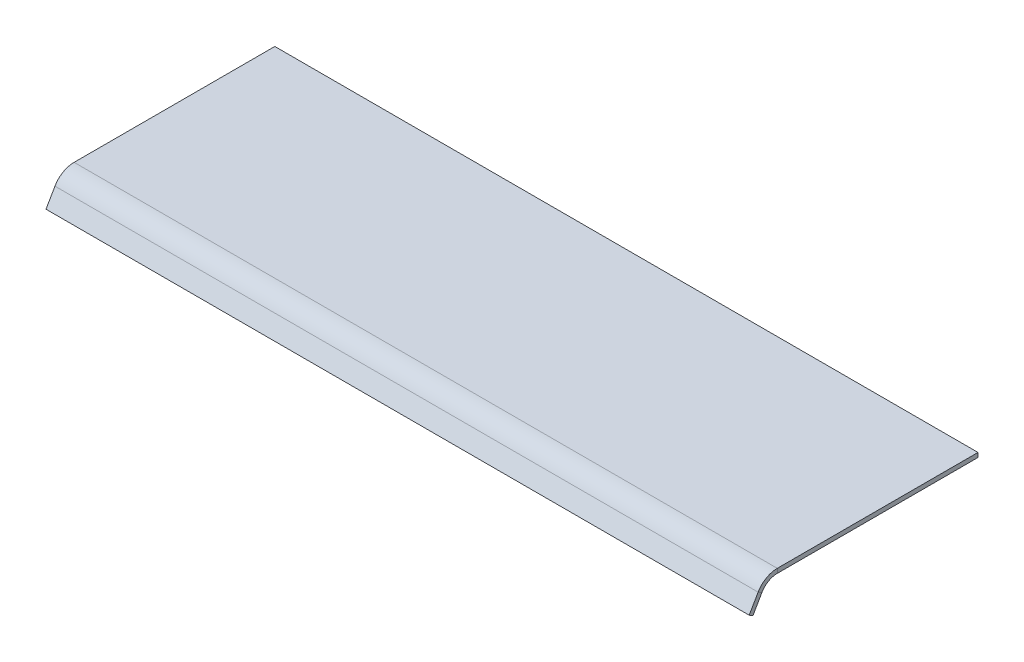
ISO-10303-21;
HEADER;
FILE_DESCRIPTION(('STEP AP214'),'2;1');
FILE_NAME('part.step','',(''),(''),'','','');
FILE_SCHEMA(('AUTOMOTIVE_DESIGN { 1 0 10303 214 1 1 1 1 }'));
ENDSEC;
DATA;
#1=APPLICATION_CONTEXT('core data for automotive mechanical design processes');
#2=APPLICATION_PROTOCOL_DEFINITION('international standard','automotive_design',2000,#1);
#3=PRODUCT_CONTEXT('',#1,'mechanical');
#4=PRODUCT('Part','Part','',(#3));
#5=PRODUCT_RELATED_PRODUCT_CATEGORY('part','',(#4));
#6=PRODUCT_DEFINITION_FORMATION('','',#4);
#7=PRODUCT_DEFINITION_CONTEXT('part definition',#1,'design');
#8=PRODUCT_DEFINITION('design','',#6,#7);
#9=PRODUCT_DEFINITION_SHAPE('','',#8);
#10=(LENGTH_UNIT() NAMED_UNIT(*) SI_UNIT(.MILLI.,.METRE.));
#11=(NAMED_UNIT(*) PLANE_ANGLE_UNIT() SI_UNIT($,.RADIAN.));
#12=(NAMED_UNIT(*) SI_UNIT($,.STERADIAN.) SOLID_ANGLE_UNIT());
#13=UNCERTAINTY_MEASURE_WITH_UNIT(LENGTH_MEASURE(1.E-05),#10,'distance_accuracy_value','');
#14=(GEOMETRIC_REPRESENTATION_CONTEXT(3) GLOBAL_UNCERTAINTY_ASSIGNED_CONTEXT((#13)) GLOBAL_UNIT_ASSIGNED_CONTEXT((#10,
#11,#12)) REPRESENTATION_CONTEXT('',''));
#15=CARTESIAN_POINT('',(0.,0.,0.));
#16=DIRECTION('',(0.,0.,1.));
#17=DIRECTION('',(1.,0.,0.));
#18=AXIS2_PLACEMENT_3D('',#15,#16,#17);
#19=CARTESIAN_POINT('',(31.75,-0.800100000000003,19.5119379503786));
#20=DIRECTION('',(1.,0.,0.));
#21=DIRECTION('',(0.,0.,-1.));
#22=AXIS2_PLACEMENT_3D('',#19,#20,#21);
#23=PLANE('',#22);
#24=DIRECTION('',(0.,0.5,0.866025403784438));
#25=VECTOR('',#24,1.);
#26=CARTESIAN_POINT('',(31.75,-0.800100000000003,19.5119379503786));
#27=LINE('',#26,#25);
#28=CARTESIAN_POINT('',(31.75,-0.800100000000003,19.5119379503786));
#29=VERTEX_POINT('',#28);
#30=CARTESIAN_POINT('',(31.75,-0.601662500000003,19.8556417825056));
#31=VERTEX_POINT('',#30);
#32=EDGE_CURVE('E11',#29,#31,#27,.T.);
#33=ORIENTED_EDGE('',*,*,#32,.F.);
#34=CARTESIAN_POINT('',(31.75,-1.6002,18.1261240992428));
#35=DIRECTION('',(-1.,0.,0.));
#36=DIRECTION('',(0.,0.,1.));
#37=AXIS2_PLACEMENT_3D('',#34,#35,#36);
#38=CIRCLE('',#37,1.6002);
#39=CARTESIAN_POINT('',(31.75,0.,18.1261240992427));
#40=VERTEX_POINT('',#39);
#41=EDGE_CURVE('E130',#40,#29,#38,.F.);
#42=ORIENTED_EDGE('',*,*,#41,.F.);
#43=DIRECTION('',(0.,-1.,0.));
#44=VECTOR('',#43,1.);
#45=CARTESIAN_POINT('',(31.75,0.396874999999999,18.1261240992427));
#46=LINE('',#45,#44);
#47=CARTESIAN_POINT('',(31.75,0.396874999999999,18.1261240992427));
#48=VERTEX_POINT('',#47);
#49=EDGE_CURVE('E41',#48,#40,#46,.T.);
#50=ORIENTED_EDGE('',*,*,#49,.F.);
#51=CARTESIAN_POINT('',(31.75,-1.6002,18.1261240992428));
#52=DIRECTION('',(1.,0.,0.));
#53=DIRECTION('',(0.,0.,-1.));
#54=AXIS2_PLACEMENT_3D('',#51,#52,#53);
#55=CIRCLE('',#54,1.997075);
#56=EDGE_CURVE('E123',#48,#31,#55,.T.);
#57=ORIENTED_EDGE('',*,*,#56,.T.);
#58=EDGE_LOOP('',(#33,#42,#50,#57));
#59=FACE_BOUND('',#58,.T.);
#60=ADVANCED_FACE('F33',(#59),#23,.T.);
#61=CARTESIAN_POINT('',(31.75,0.396874999999999,18.1261240992427));
#62=DIRECTION('',(1.,0.,0.));
#63=DIRECTION('',(0.,0.,-1.));
#64=AXIS2_PLACEMENT_3D('',#61,#62,#63);
#65=PLANE('',#64);
#66=DIRECTION('',(0.,-0.86602540378444,0.499999999999997));
#67=VECTOR('',#66,1.);
#68=CARTESIAN_POINT('',(31.75,0.,19.05));
#69=LINE('',#68,#67);
#70=CARTESIAN_POINT('',(31.75,-2.19970452561248,20.32));
#71=VERTEX_POINT('',#70);
#72=EDGE_CURVE('E179',#29,#71,#69,.T.);
#73=ORIENTED_EDGE('',*,*,#72,.F.);
#74=ORIENTED_EDGE('',*,*,#32,.T.);
#75=DIRECTION('',(0.,-0.86602540378444,0.499999999999998));
#76=VECTOR('',#75,1.);
#77=CARTESIAN_POINT('',(31.75,0.198437499999997,19.3937038321269));
#78=LINE('',#77,#76);
#79=CARTESIAN_POINT('',(31.75,-2.00126702561248,20.6637038321269));
#80=VERTEX_POINT('',#79);
#81=EDGE_CURVE('E89',#31,#80,#78,.T.);
#82=ORIENTED_EDGE('',*,*,#81,.T.);
#83=DIRECTION('',(0.,0.499999999999998,0.86602540378444));
#84=VECTOR('',#83,1.);
#85=CARTESIAN_POINT('',(31.75,-2.19970452561248,20.32));
#86=LINE('',#85,#84);
#87=EDGE_CURVE('E336',#71,#80,#86,.T.);
#88=ORIENTED_EDGE('',*,*,#87,.F.);
#89=EDGE_LOOP('',(#73,#74,#82,#88));
#90=FACE_BOUND('',#89,.T.);
#91=ADVANCED_FACE('F187',(#90),#65,.T.);
#92=CARTESIAN_POINT('',(-31.75,0.,18.1261240992427));
#93=DIRECTION('',(-1.,0.,0.));
#94=DIRECTION('',(0.,0.,1.));
#95=AXIS2_PLACEMENT_3D('',#92,#93,#94);
#96=PLANE('',#95);
#97=DIRECTION('',(0.,1.,0.));
#98=VECTOR('',#97,1.);
#99=CARTESIAN_POINT('',(-31.75,0.,18.1261240992427));
#100=LINE('',#99,#98);
#101=CARTESIAN_POINT('',(-31.75,0.,18.1261240992427));
#102=VERTEX_POINT('',#101);
#103=CARTESIAN_POINT('',(-31.75,0.396874999999999,18.1261240992427));
#104=VERTEX_POINT('',#103);
#105=EDGE_CURVE('E76',#102,#104,#100,.T.);
#106=ORIENTED_EDGE('',*,*,#105,.F.);
#107=CARTESIAN_POINT('',(-31.75,-1.6002,18.1261240992428));
#108=DIRECTION('',(-1.,0.,0.));
#109=DIRECTION('',(0.,0.,1.));
#110=AXIS2_PLACEMENT_3D('',#107,#108,#109);
#111=CIRCLE('',#110,1.6002);
#112=CARTESIAN_POINT('',(-31.75,-0.800100000000003,19.5119379503786));
#113=VERTEX_POINT('',#112);
#114=EDGE_CURVE('E145',#102,#113,#111,.F.);
#115=ORIENTED_EDGE('',*,*,#114,.T.);
#116=DIRECTION('',(0.,-0.5,-0.866025403784438));
#117=VECTOR('',#116,1.);
#118=CARTESIAN_POINT('',(-31.75,-0.601662500000003,19.8556417825056));
#119=LINE('',#118,#117);
#120=CARTESIAN_POINT('',(-31.75,-0.601662500000003,19.8556417825056));
#121=VERTEX_POINT('',#120);
#122=EDGE_CURVE('E83',#121,#113,#119,.T.);
#123=ORIENTED_EDGE('',*,*,#122,.F.);
#124=CARTESIAN_POINT('',(-31.75,-1.6002,18.1261240992428));
#125=DIRECTION('',(1.,0.,0.));
#126=DIRECTION('',(0.,0.,-1.));
#127=AXIS2_PLACEMENT_3D('',#124,#125,#126);
#128=CIRCLE('',#127,1.997075);
#129=EDGE_CURVE('E152',#104,#121,#128,.T.);
#130=ORIENTED_EDGE('',*,*,#129,.F.);
#131=EDGE_LOOP('',(#106,#115,#123,#130));
#132=FACE_BOUND('',#131,.T.);
#133=ADVANCED_FACE('F185',(#132),#96,.T.);
#134=CARTESIAN_POINT('',(-31.75,-0.601662500000003,19.8556417825056));
#135=DIRECTION('',(-1.,0.,0.));
#136=DIRECTION('',(0.,0.,1.));
#137=AXIS2_PLACEMENT_3D('',#134,#135,#136);
#138=PLANE('',#137);
#139=DIRECTION('',(0.,0.,1.));
#140=VECTOR('',#139,1.);
#141=CARTESIAN_POINT('',(-31.75,0.,0.));
#142=LINE('',#141,#140);
#143=CARTESIAN_POINT('',(-31.75,0.,0.));
#144=VERTEX_POINT('',#143);
#145=EDGE_CURVE('E147',#144,#102,#142,.T.);
#146=ORIENTED_EDGE('',*,*,#145,.T.);
#147=ORIENTED_EDGE('',*,*,#105,.T.);
#148=DIRECTION('',(0.,0.,1.));
#149=VECTOR('',#148,1.);
#150=CARTESIAN_POINT('',(-31.75,0.396875,0.));
#151=LINE('',#150,#149);
#152=CARTESIAN_POINT('',(-31.75,0.396875,0.));
#153=VERTEX_POINT('',#152);
#154=EDGE_CURVE('E150',#153,#104,#151,.T.);
#155=ORIENTED_EDGE('',*,*,#154,.F.);
#156=DIRECTION('',(0.,-1.,0.));
#157=VECTOR('',#156,1.);
#158=CARTESIAN_POINT('',(-31.75,0.396875,0.));
#159=LINE('',#158,#157);
#160=EDGE_CURVE('E111',#153,#144,#159,.T.);
#161=ORIENTED_EDGE('',*,*,#160,.T.);
#162=EDGE_LOOP('',(#146,#147,#155,#161));
#163=FACE_BOUND('',#162,.T.);
#164=ADVANCED_FACE('F181',(#163),#138,.T.);
#165=CARTESIAN_POINT('',(31.75,0.198437499999997,19.3937038321269));
#166=DIRECTION('',(0.,-0.499999999999997,-0.86602540378444));
#167=DIRECTION('',(0.,0.86602540378444,-0.499999999999997));
#168=AXIS2_PLACEMENT_3D('',#165,#166,#167);
#169=PLANE('',#168);
#170=DIRECTION('',(0.,-0.86602540378444,0.499999999999998));
#171=VECTOR('',#170,1.);
#172=CARTESIAN_POINT('',(-31.75,0.198437499999997,19.3937038321269));
#173=LINE('',#172,#171);
#174=CARTESIAN_POINT('',(-31.75,-2.00126702561248,20.6637038321269));
#175=VERTEX_POINT('',#174);
#176=EDGE_CURVE('E136',#121,#175,#173,.T.);
#177=ORIENTED_EDGE('',*,*,#176,.T.);
#178=DIRECTION('',(-1.,0.,0.));
#179=VECTOR('',#178,1.);
#180=CARTESIAN_POINT('',(31.75,-2.00126702561248,20.6637038321269));
#181=LINE('',#180,#179);
#182=EDGE_CURVE('E166',#80,#175,#181,.T.);
#183=ORIENTED_EDGE('',*,*,#182,.F.);
#184=ORIENTED_EDGE('',*,*,#81,.F.);
#185=DIRECTION('',(-1.,0.,0.));
#186=VECTOR('',#185,1.);
#187=CARTESIAN_POINT('',(31.75,-0.601662500000003,19.8556417825056));
#188=LINE('',#187,#186);
#189=EDGE_CURVE('E135',#31,#121,#188,.T.);
#190=ORIENTED_EDGE('',*,*,#189,.T.);
#191=EDGE_LOOP('',(#177,#183,#184,#190));
#192=FACE_BOUND('',#191,.T.);
#193=ADVANCED_FACE('F193',(#192),#169,.F.);
#194=CARTESIAN_POINT('',(31.75,-2.19970452561248,20.32));
#195=DIRECTION('',(0.,-0.866025403784439,0.499999999999998));
#196=DIRECTION('',(0.,-0.499999999999999,-0.86602540378444));
#197=AXIS2_PLACEMENT_3D('',#194,#195,#196);
#198=PLANE('',#197);
#199=DIRECTION('',(0.,0.499999999999998,0.86602540378444));
#200=VECTOR('',#199,1.);
#201=CARTESIAN_POINT('',(-31.75,-2.19970452561248,20.32));
#202=LINE('',#201,#200);
#203=CARTESIAN_POINT('',(-31.75,-2.19970452561248,20.32));
#204=VERTEX_POINT('',#203);
#205=EDGE_CURVE('E139',#204,#175,#202,.T.);
#206=ORIENTED_EDGE('',*,*,#205,.F.);
#207=DIRECTION('',(-1.,0.,0.));
#208=VECTOR('',#207,1.);
#209=CARTESIAN_POINT('',(31.75,-2.19970452561248,20.32));
#210=LINE('',#209,#208);
#211=EDGE_CURVE('E164',#71,#204,#210,.T.);
#212=ORIENTED_EDGE('',*,*,#211,.F.);
#213=ORIENTED_EDGE('',*,*,#87,.T.);
#214=ORIENTED_EDGE('',*,*,#182,.T.);
#215=EDGE_LOOP('',(#206,#212,#213,#214));
#216=FACE_BOUND('',#215,.T.);
#217=ADVANCED_FACE('F224',(#216),#198,.T.);
#218=CARTESIAN_POINT('',(31.75,0.,19.05));
#219=DIRECTION('',(0.,-0.499999999999997,-0.86602540378444));
#220=DIRECTION('',(0.,0.86602540378444,-0.499999999999997));
#221=AXIS2_PLACEMENT_3D('',#218,#219,#220);
#222=PLANE('',#221);
#223=DIRECTION('',(0.,-0.86602540378444,0.499999999999997));
#224=VECTOR('',#223,1.);
#225=CARTESIAN_POINT('',(-31.75,0.,19.05));
#226=LINE('',#225,#224);
#227=EDGE_CURVE('E142',#113,#204,#226,.T.);
#228=ORIENTED_EDGE('',*,*,#227,.F.);
#229=DIRECTION('',(-1.,0.,0.));
#230=VECTOR('',#229,1.);
#231=CARTESIAN_POINT('',(31.75,-0.800100000000003,19.5119379503786));
#232=LINE('',#231,#230);
#233=EDGE_CURVE('E161',#29,#113,#232,.T.);
#234=ORIENTED_EDGE('',*,*,#233,.F.);
#235=ORIENTED_EDGE('',*,*,#72,.T.);
#236=ORIENTED_EDGE('',*,*,#211,.T.);
#237=EDGE_LOOP('',(#228,#234,#235,#236));
#238=FACE_BOUND('',#237,.T.);
#239=ADVANCED_FACE('F235',(#238),#222,.T.);
#240=CARTESIAN_POINT('',(31.75,-1.6002,18.1261240992428));
#241=DIRECTION('',(-1.,0.,0.));
#242=DIRECTION('',(0.,0.,1.));
#243=AXIS2_PLACEMENT_3D('',#240,#241,#242);
#244=CYLINDRICAL_SURFACE('',#243,1.6002);
#245=ORIENTED_EDGE('',*,*,#114,.F.);
#246=DIRECTION('',(-1.,0.,0.));
#247=VECTOR('',#246,1.);
#248=CARTESIAN_POINT('',(31.75,0.,18.1261240992427));
#249=LINE('',#248,#247);
#250=EDGE_CURVE('E158',#40,#102,#249,.T.);
#251=ORIENTED_EDGE('',*,*,#250,.F.);
#252=ORIENTED_EDGE('',*,*,#41,.T.);
#253=ORIENTED_EDGE('',*,*,#233,.T.);
#254=EDGE_LOOP('',(#245,#251,#252,#253));
#255=FACE_BOUND('',#254,.T.);
#256=ADVANCED_FACE('F175',(#255),#244,.F.);
#257=CARTESIAN_POINT('',(31.75,0.,0.));
#258=DIRECTION('',(0.,-1.,0.));
#259=DIRECTION('',(0.,0.,-1.));
#260=AXIS2_PLACEMENT_3D('',#257,#258,#259);
#261=PLANE('',#260);
#262=ORIENTED_EDGE('',*,*,#145,.F.);
#263=DIRECTION('',(-1.,0.,0.));
#264=VECTOR('',#263,1.);
#265=CARTESIAN_POINT('',(31.75,0.,0.));
#266=LINE('',#265,#264);
#267=CARTESIAN_POINT('',(31.75,0.,0.));
#268=VERTEX_POINT('',#267);
#269=EDGE_CURVE('E113',#268,#144,#266,.T.);
#270=ORIENTED_EDGE('',*,*,#269,.F.);
#271=DIRECTION('',(0.,0.,1.));
#272=VECTOR('',#271,1.);
#273=CARTESIAN_POINT('',(31.75,0.,0.));
#274=LINE('',#273,#272);
#275=EDGE_CURVE('E128',#268,#40,#274,.T.);
#276=ORIENTED_EDGE('',*,*,#275,.T.);
#277=ORIENTED_EDGE('',*,*,#250,.T.);
#278=EDGE_LOOP('',(#262,#270,#276,#277));
#279=FACE_BOUND('',#278,.T.);
#280=ADVANCED_FACE('F180',(#279),#261,.T.);
#281=CARTESIAN_POINT('',(31.75,0.396875,0.));
#282=DIRECTION('',(0.,0.,-1.));
#283=DIRECTION('',(0.,1.,0.));
#284=AXIS2_PLACEMENT_3D('',#281,#282,#283);
#285=PLANE('',#284);
#286=ORIENTED_EDGE('',*,*,#160,.F.);
#287=DIRECTION('',(-1.,0.,0.));
#288=VECTOR('',#287,1.);
#289=CARTESIAN_POINT('',(31.75,0.396875,0.));
#290=LINE('',#289,#288);
#291=CARTESIAN_POINT('',(31.75,0.396875,0.));
#292=VERTEX_POINT('',#291);
#293=EDGE_CURVE('E105',#292,#153,#290,.T.);
#294=ORIENTED_EDGE('',*,*,#293,.F.);
#295=DIRECTION('',(0.,-1.,0.));
#296=VECTOR('',#295,1.);
#297=CARTESIAN_POINT('',(31.75,0.396875,0.));
#298=LINE('',#297,#296);
#299=EDGE_CURVE('E109',#292,#268,#298,.T.);
#300=ORIENTED_EDGE('',*,*,#299,.T.);
#301=ORIENTED_EDGE('',*,*,#269,.T.);
#302=EDGE_LOOP('',(#286,#294,#300,#301));
#303=FACE_BOUND('',#302,.T.);
#304=ADVANCED_FACE('F107',(#303),#285,.T.);
#305=CARTESIAN_POINT('',(31.75,0.396875,0.));
#306=DIRECTION('',(0.,-1.,0.));
#307=DIRECTION('',(0.,0.,-1.));
#308=AXIS2_PLACEMENT_3D('',#305,#306,#307);
#309=PLANE('',#308);
#310=ORIENTED_EDGE('',*,*,#154,.T.);
#311=DIRECTION('',(-1.,0.,0.));
#312=VECTOR('',#311,1.);
#313=CARTESIAN_POINT('',(31.75,0.396874999999999,18.1261240992427));
#314=LINE('',#313,#312);
#315=EDGE_CURVE('E114',#48,#104,#314,.T.);
#316=ORIENTED_EDGE('',*,*,#315,.F.);
#317=DIRECTION('',(0.,0.,1.));
#318=VECTOR('',#317,1.);
#319=CARTESIAN_POINT('',(31.75,0.396875,0.));
#320=LINE('',#319,#318);
#321=EDGE_CURVE('E118',#292,#48,#320,.T.);
#322=ORIENTED_EDGE('',*,*,#321,.F.);
#323=ORIENTED_EDGE('',*,*,#293,.T.);
#324=EDGE_LOOP('',(#310,#316,#322,#323));
#325=FACE_BOUND('',#324,.T.);
#326=ADVANCED_FACE('F119',(#325),#309,.F.);
#327=CARTESIAN_POINT('',(31.75,-1.6002,18.1261240992428));
#328=DIRECTION('',(-1.,0.,0.));
#329=DIRECTION('',(0.,0.,1.));
#330=AXIS2_PLACEMENT_3D('',#327,#328,#329);
#331=CYLINDRICAL_SURFACE('',#330,1.997075);
#332=ORIENTED_EDGE('',*,*,#129,.T.);
#333=ORIENTED_EDGE('',*,*,#189,.F.);
#334=ORIENTED_EDGE('',*,*,#56,.F.);
#335=ORIENTED_EDGE('',*,*,#315,.T.);
#336=EDGE_LOOP('',(#332,#333,#334,#335));
#337=FACE_BOUND('',#336,.T.);
#338=ADVANCED_FACE('F183',(#337),#331,.T.);
#339=CARTESIAN_POINT('',(31.75,-1.6002,18.1261240992428));
#340=DIRECTION('',(-1.,0.,0.));
#341=DIRECTION('',(0.,0.,1.));
#342=AXIS2_PLACEMENT_3D('',#339,#340,#341);
#343=PLANE('',#342);
#344=ORIENTED_EDGE('',*,*,#321,.T.);
#345=ORIENTED_EDGE('',*,*,#49,.T.);
#346=ORIENTED_EDGE('',*,*,#275,.F.);
#347=ORIENTED_EDGE('',*,*,#299,.F.);
#348=EDGE_LOOP('',(#344,#345,#346,#347));
#349=FACE_BOUND('',#348,.T.);
#350=ADVANCED_FACE('F126',(#349),#343,.F.);
#351=CARTESIAN_POINT('',(-31.75,-1.6002,18.1261240992428));
#352=DIRECTION('',(-1.,0.,0.));
#353=DIRECTION('',(0.,0.,1.));
#354=AXIS2_PLACEMENT_3D('',#351,#352,#353);
#355=PLANE('',#354);
#356=ORIENTED_EDGE('',*,*,#176,.F.);
#357=ORIENTED_EDGE('',*,*,#122,.T.);
#358=ORIENTED_EDGE('',*,*,#227,.T.);
#359=ORIENTED_EDGE('',*,*,#205,.T.);
#360=EDGE_LOOP('',(#356,#357,#358,#359));
#361=FACE_BOUND('',#360,.T.);
#362=ADVANCED_FACE('F301',(#361),#355,.T.);
#363=CLOSED_SHELL('',(#60,#91,#133,#164,#193,#217,#239,#256,#280,#304,#326,#338,#350,#362));
#364=MANIFOLD_SOLID_BREP('B2',#363);
#365=ADVANCED_BREP_SHAPE_REPRESENTATION('',(#18,#364),#14);
#366=SHAPE_DEFINITION_REPRESENTATION(#9,#365);
ENDSEC;
END-ISO-10303-21;
